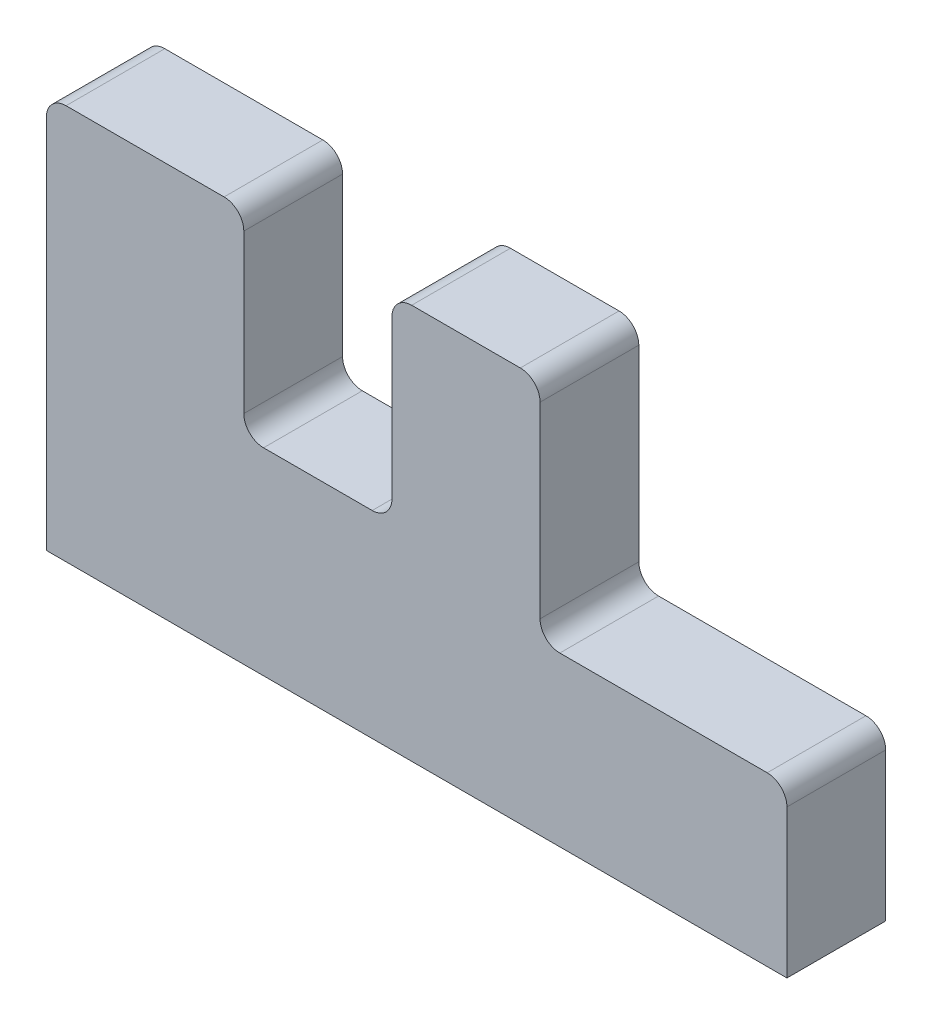
ISO-10303-21;
HEADER;
FILE_DESCRIPTION(('STEP AP214'),'2;1');
FILE_NAME('part.step','',(''),(''),'','','');
FILE_SCHEMA(('AUTOMOTIVE_DESIGN { 1 0 10303 214 1 1 1 1 }'));
ENDSEC;
DATA;
#1=APPLICATION_CONTEXT('core data for automotive mechanical design processes');
#2=APPLICATION_PROTOCOL_DEFINITION('international standard','automotive_design',2000,#1);
#3=PRODUCT_CONTEXT('',#1,'mechanical');
#4=PRODUCT('Part','Part','',(#3));
#5=PRODUCT_RELATED_PRODUCT_CATEGORY('part','',(#4));
#6=PRODUCT_DEFINITION_FORMATION('','',#4);
#7=PRODUCT_DEFINITION_CONTEXT('part definition',#1,'design');
#8=PRODUCT_DEFINITION('design','',#6,#7);
#9=PRODUCT_DEFINITION_SHAPE('','',#8);
#10=(LENGTH_UNIT() NAMED_UNIT(*) SI_UNIT(.MILLI.,.METRE.));
#11=(NAMED_UNIT(*) PLANE_ANGLE_UNIT() SI_UNIT($,.RADIAN.));
#12=(NAMED_UNIT(*) SI_UNIT($,.STERADIAN.) SOLID_ANGLE_UNIT());
#13=UNCERTAINTY_MEASURE_WITH_UNIT(LENGTH_MEASURE(1.E-05),#10,'distance_accuracy_value','');
#14=(GEOMETRIC_REPRESENTATION_CONTEXT(3) GLOBAL_UNCERTAINTY_ASSIGNED_CONTEXT((#13)) GLOBAL_UNIT_ASSIGNED_CONTEXT((#10,
#11,#12)) REPRESENTATION_CONTEXT('',''));
#15=CARTESIAN_POINT('',(0.,0.,0.));
#16=DIRECTION('',(0.,0.,1.));
#17=DIRECTION('',(1.,0.,0.));
#18=AXIS2_PLACEMENT_3D('',#15,#16,#17);
#19=CARTESIAN_POINT('',(95.25,0.,12.7));
#20=DIRECTION('',(0.,1.,0.));
#21=DIRECTION('',(0.,0.,1.));
#22=AXIS2_PLACEMENT_3D('',#19,#20,#21);
#23=PLANE('',#22);
#24=DIRECTION('',(1.,0.,0.));
#25=VECTOR('',#24,1.);
#26=CARTESIAN_POINT('',(95.25,0.,0.));
#27=LINE('',#26,#25);
#28=CARTESIAN_POINT('',(0.,0.,0.));
#29=VERTEX_POINT('',#28);
#30=CARTESIAN_POINT('',(95.25,0.,0.));
#31=VERTEX_POINT('',#30);
#32=EDGE_CURVE('E183',#29,#31,#27,.T.);
#33=ORIENTED_EDGE('',*,*,#32,.T.);
#34=DIRECTION('',(0.,0.,-1.));
#35=VECTOR('',#34,1.);
#36=CARTESIAN_POINT('',(95.25,0.,12.7));
#37=LINE('',#36,#35);
#38=CARTESIAN_POINT('',(95.25,0.,12.7));
#39=VERTEX_POINT('',#38);
#40=EDGE_CURVE('E164',#39,#31,#37,.T.);
#41=ORIENTED_EDGE('',*,*,#40,.F.);
#42=DIRECTION('',(1.,0.,0.));
#43=VECTOR('',#42,1.);
#44=CARTESIAN_POINT('',(95.25,0.,12.7));
#45=LINE('',#44,#43);
#46=CARTESIAN_POINT('',(0.,0.,12.7));
#47=VERTEX_POINT('',#46);
#48=EDGE_CURVE('E170',#47,#39,#45,.T.);
#49=ORIENTED_EDGE('',*,*,#48,.F.);
#50=DIRECTION('',(0.,0.,-1.));
#51=VECTOR('',#50,1.);
#52=CARTESIAN_POINT('',(0.,0.,12.7));
#53=LINE('',#52,#51);
#54=EDGE_CURVE('E185',#47,#29,#53,.T.);
#55=ORIENTED_EDGE('',*,*,#54,.T.);
#56=EDGE_LOOP('',(#33,#41,#49,#55));
#57=FACE_BOUND('',#56,.T.);
#58=ADVANCED_FACE('F33',(#57),#23,.F.);
#59=CARTESIAN_POINT('',(95.25,21.59,12.7));
#60=DIRECTION('',(-1.,0.,0.));
#61=DIRECTION('',(0.,0.,1.));
#62=AXIS2_PLACEMENT_3D('',#59,#60,#61);
#63=PLANE('',#62);
#64=DIRECTION('',(0.,1.,0.));
#65=VECTOR('',#64,1.);
#66=CARTESIAN_POINT('',(95.25,21.59,0.));
#67=LINE('',#66,#65);
#68=CARTESIAN_POINT('',(95.25,19.05,0.));
#69=VERTEX_POINT('',#68);
#70=EDGE_CURVE('E270',#31,#69,#67,.T.);
#71=ORIENTED_EDGE('',*,*,#70,.T.);
#72=DIRECTION('',(0.,0.,-1.));
#73=VECTOR('',#72,1.);
#74=CARTESIAN_POINT('',(95.25,19.05,12.7));
#75=LINE('',#74,#73);
#76=CARTESIAN_POINT('',(95.25,19.05,12.7));
#77=VERTEX_POINT('',#76);
#78=EDGE_CURVE('E167',#69,#77,#75,.F.);
#79=ORIENTED_EDGE('',*,*,#78,.T.);
#80=DIRECTION('',(0.,1.,0.));
#81=VECTOR('',#80,1.);
#82=CARTESIAN_POINT('',(95.25,21.59,12.7));
#83=LINE('',#82,#81);
#84=EDGE_CURVE('E159',#39,#77,#83,.T.);
#85=ORIENTED_EDGE('',*,*,#84,.F.);
#86=ORIENTED_EDGE('',*,*,#40,.T.);
#87=EDGE_LOOP('',(#71,#79,#85,#86));
#88=FACE_BOUND('',#87,.T.);
#89=ADVANCED_FACE('F162',(#88),#63,.F.);
#90=CARTESIAN_POINT('',(63.5,21.59,12.7));
#91=DIRECTION('',(0.,-1.,0.));
#92=DIRECTION('',(0.,0.,-1.));
#93=AXIS2_PLACEMENT_3D('',#90,#91,#92);
#94=PLANE('',#93);
#95=DIRECTION('',(-1.,0.,0.));
#96=VECTOR('',#95,1.);
#97=CARTESIAN_POINT('',(63.5,21.59,12.7));
#98=LINE('',#97,#96);
#99=CARTESIAN_POINT('',(92.71,21.59,12.7));
#100=VERTEX_POINT('',#99);
#101=CARTESIAN_POINT('',(66.04,21.59,12.7));
#102=VERTEX_POINT('',#101);
#103=EDGE_CURVE('E169',#100,#102,#98,.T.);
#104=ORIENTED_EDGE('',*,*,#103,.F.);
#105=DIRECTION('',(0.,0.,-1.));
#106=VECTOR('',#105,1.);
#107=CARTESIAN_POINT('',(92.71,21.59,12.7));
#108=LINE('',#107,#106);
#109=CARTESIAN_POINT('',(92.71,21.59,0.));
#110=VERTEX_POINT('',#109);
#111=EDGE_CURVE('E238',#100,#110,#108,.T.);
#112=ORIENTED_EDGE('',*,*,#111,.T.);
#113=DIRECTION('',(-1.,0.,0.));
#114=VECTOR('',#113,1.);
#115=CARTESIAN_POINT('',(63.5,21.59,0.));
#116=LINE('',#115,#114);
#117=CARTESIAN_POINT('',(66.04,21.59,0.));
#118=VERTEX_POINT('',#117);
#119=EDGE_CURVE('E259',#110,#118,#116,.T.);
#120=ORIENTED_EDGE('',*,*,#119,.T.);
#121=DIRECTION('',(0.,0.,-1.));
#122=VECTOR('',#121,1.);
#123=CARTESIAN_POINT('',(66.04,21.59,12.7));
#124=LINE('',#123,#122);
#125=EDGE_CURVE('E236',#118,#102,#124,.F.);
#126=ORIENTED_EDGE('',*,*,#125,.T.);
#127=EDGE_LOOP('',(#104,#112,#120,#126));
#128=FACE_BOUND('',#127,.T.);
#129=ADVANCED_FACE('F267',(#128),#94,.F.);
#130=CARTESIAN_POINT('',(63.5,50.8,12.7));
#131=DIRECTION('',(-1.,0.,0.));
#132=DIRECTION('',(0.,0.,1.));
#133=AXIS2_PLACEMENT_3D('',#130,#131,#132);
#134=PLANE('',#133);
#135=DIRECTION('',(0.,1.,0.));
#136=VECTOR('',#135,1.);
#137=CARTESIAN_POINT('',(63.5,50.8,12.7));
#138=LINE('',#137,#136);
#139=CARTESIAN_POINT('',(63.5,24.13,12.7));
#140=VERTEX_POINT('',#139);
#141=CARTESIAN_POINT('',(63.5,48.26,12.7));
#142=VERTEX_POINT('',#141);
#143=EDGE_CURVE('E276',#140,#142,#138,.T.);
#144=ORIENTED_EDGE('',*,*,#143,.F.);
#145=DIRECTION('',(0.,0.,-1.));
#146=VECTOR('',#145,1.);
#147=CARTESIAN_POINT('',(63.5,24.13,0.));
#148=LINE('',#147,#146);
#149=CARTESIAN_POINT('',(63.5,24.13,0.));
#150=VERTEX_POINT('',#149);
#151=EDGE_CURVE('E244',#140,#150,#148,.T.);
#152=ORIENTED_EDGE('',*,*,#151,.T.);
#153=DIRECTION('',(0.,1.,0.));
#154=VECTOR('',#153,1.);
#155=CARTESIAN_POINT('',(63.5,50.8,0.));
#156=LINE('',#155,#154);
#157=CARTESIAN_POINT('',(63.5,48.26,0.));
#158=VERTEX_POINT('',#157);
#159=EDGE_CURVE('E261',#150,#158,#156,.T.);
#160=ORIENTED_EDGE('',*,*,#159,.T.);
#161=DIRECTION('',(0.,0.,-1.));
#162=VECTOR('',#161,1.);
#163=CARTESIAN_POINT('',(63.5,48.26,12.7));
#164=LINE('',#163,#162);
#165=EDGE_CURVE('E242',#158,#142,#164,.F.);
#166=ORIENTED_EDGE('',*,*,#165,.T.);
#167=EDGE_LOOP('',(#144,#152,#160,#166));
#168=FACE_BOUND('',#167,.T.);
#169=ADVANCED_FACE('F279',(#168),#134,.F.);
#170=CARTESIAN_POINT('',(44.45,50.8,12.7));
#171=DIRECTION('',(0.,-1.,0.));
#172=DIRECTION('',(0.,0.,-1.));
#173=AXIS2_PLACEMENT_3D('',#170,#171,#172);
#174=PLANE('',#173);
#175=DIRECTION('',(-1.,0.,0.));
#176=VECTOR('',#175,1.);
#177=CARTESIAN_POINT('',(44.45,50.8,0.));
#178=LINE('',#177,#176);
#179=CARTESIAN_POINT('',(60.96,50.8,0.));
#180=VERTEX_POINT('',#179);
#181=CARTESIAN_POINT('',(46.99,50.8,0.));
#182=VERTEX_POINT('',#181);
#183=EDGE_CURVE('E300',#180,#182,#178,.T.);
#184=ORIENTED_EDGE('',*,*,#183,.T.);
#185=DIRECTION('',(0.,0.,-1.));
#186=VECTOR('',#185,1.);
#187=CARTESIAN_POINT('',(46.99,50.8,12.7));
#188=LINE('',#187,#186);
#189=CARTESIAN_POINT('',(46.99,50.8,12.7));
#190=VERTEX_POINT('',#189);
#191=EDGE_CURVE('E234',#182,#190,#188,.F.);
#192=ORIENTED_EDGE('',*,*,#191,.T.);
#193=DIRECTION('',(-1.,0.,0.));
#194=VECTOR('',#193,1.);
#195=CARTESIAN_POINT('',(44.45,50.8,12.7));
#196=LINE('',#195,#194);
#197=CARTESIAN_POINT('',(60.96,50.8,12.7));
#198=VERTEX_POINT('',#197);
#199=EDGE_CURVE('E281',#198,#190,#196,.T.);
#200=ORIENTED_EDGE('',*,*,#199,.F.);
#201=DIRECTION('',(0.,0.,-1.));
#202=VECTOR('',#201,1.);
#203=CARTESIAN_POINT('',(60.96,50.8,12.7));
#204=LINE('',#203,#202);
#205=EDGE_CURVE('E231',#198,#180,#204,.T.);
#206=ORIENTED_EDGE('',*,*,#205,.T.);
#207=EDGE_LOOP('',(#184,#192,#200,#206));
#208=FACE_BOUND('',#207,.T.);
#209=ADVANCED_FACE('F387',(#208),#174,.F.);
#210=CARTESIAN_POINT('',(44.45,25.4,12.7));
#211=DIRECTION('',(1.,0.,0.));
#212=DIRECTION('',(0.,0.,-1.));
#213=AXIS2_PLACEMENT_3D('',#210,#211,#212);
#214=PLANE('',#213);
#215=DIRECTION('',(0.,-1.,0.));
#216=VECTOR('',#215,1.);
#217=CARTESIAN_POINT('',(44.45,25.4,0.));
#218=LINE('',#217,#216);
#219=CARTESIAN_POINT('',(44.45,48.26,0.));
#220=VERTEX_POINT('',#219);
#221=CARTESIAN_POINT('',(44.45,27.94,0.));
#222=VERTEX_POINT('',#221);
#223=EDGE_CURVE('E303',#220,#222,#218,.T.);
#224=ORIENTED_EDGE('',*,*,#223,.T.);
#225=DIRECTION('',(0.,0.,-1.));
#226=VECTOR('',#225,1.);
#227=CARTESIAN_POINT('',(44.45,27.94,12.7));
#228=LINE('',#227,#226);
#229=CARTESIAN_POINT('',(44.45,27.94,12.7));
#230=VERTEX_POINT('',#229);
#231=EDGE_CURVE('E229',#222,#230,#228,.F.);
#232=ORIENTED_EDGE('',*,*,#231,.T.);
#233=DIRECTION('',(0.,-1.,0.));
#234=VECTOR('',#233,1.);
#235=CARTESIAN_POINT('',(44.45,25.4,12.7));
#236=LINE('',#235,#234);
#237=CARTESIAN_POINT('',(44.45,48.26,12.7));
#238=VERTEX_POINT('',#237);
#239=EDGE_CURVE('E284',#238,#230,#236,.T.);
#240=ORIENTED_EDGE('',*,*,#239,.F.);
#241=DIRECTION('',(0.,0.,-1.));
#242=VECTOR('',#241,1.);
#243=CARTESIAN_POINT('',(44.45,48.26,12.7));
#244=LINE('',#243,#242);
#245=EDGE_CURVE('E226',#238,#220,#244,.T.);
#246=ORIENTED_EDGE('',*,*,#245,.T.);
#247=EDGE_LOOP('',(#224,#232,#240,#246));
#248=FACE_BOUND('',#247,.T.);
#249=ADVANCED_FACE('F384',(#248),#214,.F.);
#250=CARTESIAN_POINT('',(25.4,25.4,12.7));
#251=DIRECTION('',(0.,-1.,0.));
#252=DIRECTION('',(0.,0.,-1.));
#253=AXIS2_PLACEMENT_3D('',#250,#251,#252);
#254=PLANE('',#253);
#255=DIRECTION('',(-1.,0.,0.));
#256=VECTOR('',#255,1.);
#257=CARTESIAN_POINT('',(25.4,25.4,0.));
#258=LINE('',#257,#256);
#259=CARTESIAN_POINT('',(41.91,25.4,0.));
#260=VERTEX_POINT('',#259);
#261=CARTESIAN_POINT('',(27.94,25.4,0.));
#262=VERTEX_POINT('',#261);
#263=EDGE_CURVE('E306',#260,#262,#258,.T.);
#264=ORIENTED_EDGE('',*,*,#263,.T.);
#265=DIRECTION('',(0.,0.,-1.));
#266=VECTOR('',#265,1.);
#267=CARTESIAN_POINT('',(27.94,25.4,12.7));
#268=LINE('',#267,#266);
#269=CARTESIAN_POINT('',(27.94,25.4,12.7));
#270=VERTEX_POINT('',#269);
#271=EDGE_CURVE('E224',#262,#270,#268,.F.);
#272=ORIENTED_EDGE('',*,*,#271,.T.);
#273=DIRECTION('',(-1.,0.,0.));
#274=VECTOR('',#273,1.);
#275=CARTESIAN_POINT('',(25.4,25.4,12.7));
#276=LINE('',#275,#274);
#277=CARTESIAN_POINT('',(41.91,25.4,12.7));
#278=VERTEX_POINT('',#277);
#279=EDGE_CURVE('E290',#278,#270,#276,.T.);
#280=ORIENTED_EDGE('',*,*,#279,.F.);
#281=DIRECTION('',(0.,0.,-1.));
#282=VECTOR('',#281,1.);
#283=CARTESIAN_POINT('',(41.91,25.4,0.));
#284=LINE('',#283,#282);
#285=EDGE_CURVE('E221',#278,#260,#284,.T.);
#286=ORIENTED_EDGE('',*,*,#285,.T.);
#287=EDGE_LOOP('',(#264,#272,#280,#286));
#288=FACE_BOUND('',#287,.T.);
#289=ADVANCED_FACE('F358',(#288),#254,.F.);
#290=CARTESIAN_POINT('',(25.4,50.8,12.7));
#291=DIRECTION('',(-1.,0.,0.));
#292=DIRECTION('',(0.,-1.,0.));
#293=AXIS2_PLACEMENT_3D('',#290,#291,#292);
#294=PLANE('',#293);
#295=DIRECTION('',(0.,1.,0.));
#296=VECTOR('',#295,1.);
#297=CARTESIAN_POINT('',(25.4,50.8,0.));
#298=LINE('',#297,#296);
#299=CARTESIAN_POINT('',(25.4,27.94,0.));
#300=VERTEX_POINT('',#299);
#301=CARTESIAN_POINT('',(25.4,48.26,0.));
#302=VERTEX_POINT('',#301);
#303=EDGE_CURVE('E309',#300,#302,#298,.T.);
#304=ORIENTED_EDGE('',*,*,#303,.T.);
#305=DIRECTION('',(0.,0.,-1.));
#306=VECTOR('',#305,1.);
#307=CARTESIAN_POINT('',(25.4,48.26,12.7));
#308=LINE('',#307,#306);
#309=CARTESIAN_POINT('',(25.4,48.26,12.7));
#310=VERTEX_POINT('',#309);
#311=EDGE_CURVE('E48',#302,#310,#308,.F.);
#312=ORIENTED_EDGE('',*,*,#311,.T.);
#313=DIRECTION('',(0.,1.,0.));
#314=VECTOR('',#313,1.);
#315=CARTESIAN_POINT('',(25.4,50.8,12.7));
#316=LINE('',#315,#314);
#317=CARTESIAN_POINT('',(25.4,27.94,12.7));
#318=VERTEX_POINT('',#317);
#319=EDGE_CURVE('E292',#318,#310,#316,.T.);
#320=ORIENTED_EDGE('',*,*,#319,.F.);
#321=DIRECTION('',(0.,0.,-1.));
#322=VECTOR('',#321,1.);
#323=CARTESIAN_POINT('',(25.4,27.94,0.));
#324=LINE('',#323,#322);
#325=EDGE_CURVE('E217',#318,#300,#324,.T.);
#326=ORIENTED_EDGE('',*,*,#325,.T.);
#327=EDGE_LOOP('',(#304,#312,#320,#326));
#328=FACE_BOUND('',#327,.T.);
#329=ADVANCED_FACE('F363',(#328),#294,.F.);
#330=CARTESIAN_POINT('',(0.,50.8,12.7));
#331=DIRECTION('',(0.,-1.,0.));
#332=DIRECTION('',(0.,0.,-1.));
#333=AXIS2_PLACEMENT_3D('',#330,#331,#332);
#334=PLANE('',#333);
#335=DIRECTION('',(-1.,0.,0.));
#336=VECTOR('',#335,1.);
#337=CARTESIAN_POINT('',(0.,50.8,0.));
#338=LINE('',#337,#336);
#339=CARTESIAN_POINT('',(22.86,50.8,0.));
#340=VERTEX_POINT('',#339);
#341=CARTESIAN_POINT('',(2.54,50.8,0.));
#342=VERTEX_POINT('',#341);
#343=EDGE_CURVE('E311',#340,#342,#338,.T.);
#344=ORIENTED_EDGE('',*,*,#343,.T.);
#345=DIRECTION('',(0.,0.,-1.));
#346=VECTOR('',#345,1.);
#347=CARTESIAN_POINT('',(2.54,50.8,12.7));
#348=LINE('',#347,#346);
#349=CARTESIAN_POINT('',(2.54,50.8,12.7));
#350=VERTEX_POINT('',#349);
#351=EDGE_CURVE('E205',#342,#350,#348,.F.);
#352=ORIENTED_EDGE('',*,*,#351,.T.);
#353=DIRECTION('',(-1.,0.,0.));
#354=VECTOR('',#353,1.);
#355=CARTESIAN_POINT('',(0.,50.8,12.7));
#356=LINE('',#355,#354);
#357=CARTESIAN_POINT('',(22.86,50.8,12.7));
#358=VERTEX_POINT('',#357);
#359=EDGE_CURVE('E294',#358,#350,#356,.T.);
#360=ORIENTED_EDGE('',*,*,#359,.F.);
#361=DIRECTION('',(0.,0.,-1.));
#362=VECTOR('',#361,1.);
#363=CARTESIAN_POINT('',(22.86,50.8,12.7));
#364=LINE('',#363,#362);
#365=EDGE_CURVE('E202',#358,#340,#364,.T.);
#366=ORIENTED_EDGE('',*,*,#365,.T.);
#367=EDGE_LOOP('',(#344,#352,#360,#366));
#368=FACE_BOUND('',#367,.T.);
#369=ADVANCED_FACE('F369',(#368),#334,.F.);
#370=CARTESIAN_POINT('',(0.,0.,12.7));
#371=DIRECTION('',(1.,0.,0.));
#372=DIRECTION('',(0.,0.,-1.));
#373=AXIS2_PLACEMENT_3D('',#370,#371,#372);
#374=PLANE('',#373);
#375=DIRECTION('',(0.,-1.,0.));
#376=VECTOR('',#375,1.);
#377=CARTESIAN_POINT('',(0.,0.,12.7));
#378=LINE('',#377,#376);
#379=CARTESIAN_POINT('',(0.,48.26,12.7));
#380=VERTEX_POINT('',#379);
#381=EDGE_CURVE('E176',#380,#47,#378,.T.);
#382=ORIENTED_EDGE('',*,*,#381,.F.);
#383=DIRECTION('',(0.,0.,-1.));
#384=VECTOR('',#383,1.);
#385=CARTESIAN_POINT('',(0.,48.26,12.7));
#386=LINE('',#385,#384);
#387=CARTESIAN_POINT('',(0.,48.26,0.));
#388=VERTEX_POINT('',#387);
#389=EDGE_CURVE('E184',#380,#388,#386,.T.);
#390=ORIENTED_EDGE('',*,*,#389,.T.);
#391=DIRECTION('',(0.,-1.,0.));
#392=VECTOR('',#391,1.);
#393=CARTESIAN_POINT('',(0.,0.,0.));
#394=LINE('',#393,#392);
#395=EDGE_CURVE('E180',#388,#29,#394,.T.);
#396=ORIENTED_EDGE('',*,*,#395,.T.);
#397=ORIENTED_EDGE('',*,*,#54,.F.);
#398=EDGE_LOOP('',(#382,#390,#396,#397));
#399=FACE_BOUND('',#398,.T.);
#400=ADVANCED_FACE('F314',(#399),#374,.F.);
#401=CARTESIAN_POINT('',(0.,0.,12.7));
#402=DIRECTION('',(0.,0.,-1.));
#403=DIRECTION('',(-1.,0.,0.));
#404=AXIS2_PLACEMENT_3D('',#401,#402,#403);
#405=PLANE('',#404);
#406=ORIENTED_EDGE('',*,*,#359,.T.);
#407=CARTESIAN_POINT('',(2.54,48.26,12.7));
#408=DIRECTION('',(0.,0.,-1.));
#409=DIRECTION('',(-1.,0.,0.));
#410=AXIS2_PLACEMENT_3D('',#407,#408,#409);
#411=CIRCLE('',#410,2.54);
#412=EDGE_CURVE('E215',#350,#380,#411,.F.);
#413=ORIENTED_EDGE('',*,*,#412,.T.);
#414=ORIENTED_EDGE('',*,*,#381,.T.);
#415=ORIENTED_EDGE('',*,*,#48,.T.);
#416=ORIENTED_EDGE('',*,*,#84,.T.);
#417=CARTESIAN_POINT('',(92.71,19.05,12.7));
#418=DIRECTION('',(0.,0.,-1.));
#419=DIRECTION('',(-1.,0.,0.));
#420=AXIS2_PLACEMENT_3D('',#417,#418,#419);
#421=CIRCLE('',#420,2.54);
#422=EDGE_CURVE('E209',#77,#100,#421,.F.);
#423=ORIENTED_EDGE('',*,*,#422,.T.);
#424=ORIENTED_EDGE('',*,*,#103,.T.);
#425=CARTESIAN_POINT('',(66.04,24.13,12.7));
#426=DIRECTION('',(0.,0.,-1.));
#427=DIRECTION('',(-1.,0.,0.));
#428=AXIS2_PLACEMENT_3D('',#425,#426,#427);
#429=CIRCLE('',#428,2.54);
#430=EDGE_CURVE('E11',#102,#140,#429,.T.);
#431=ORIENTED_EDGE('',*,*,#430,.T.);
#432=ORIENTED_EDGE('',*,*,#143,.T.);
#433=CARTESIAN_POINT('',(60.96,48.26,12.7));
#434=DIRECTION('',(0.,0.,-1.));
#435=DIRECTION('',(-1.,0.,0.));
#436=AXIS2_PLACEMENT_3D('',#433,#434,#435);
#437=CIRCLE('',#436,2.54);
#438=EDGE_CURVE('E207',#142,#198,#437,.F.);
#439=ORIENTED_EDGE('',*,*,#438,.T.);
#440=ORIENTED_EDGE('',*,*,#199,.T.);
#441=CARTESIAN_POINT('',(46.99,48.26,12.7));
#442=DIRECTION('',(0.,0.,-1.));
#443=DIRECTION('',(-1.,0.,0.));
#444=AXIS2_PLACEMENT_3D('',#441,#442,#443);
#445=CIRCLE('',#444,2.54);
#446=EDGE_CURVE('E211',#190,#238,#445,.F.);
#447=ORIENTED_EDGE('',*,*,#446,.T.);
#448=ORIENTED_EDGE('',*,*,#239,.T.);
#449=CARTESIAN_POINT('',(41.91,27.94,12.7));
#450=DIRECTION('',(0.,0.,-1.));
#451=DIRECTION('',(-1.,0.,0.));
#452=AXIS2_PLACEMENT_3D('',#449,#450,#451);
#453=CIRCLE('',#452,2.54);
#454=EDGE_CURVE('E252',#230,#278,#453,.T.);
#455=ORIENTED_EDGE('',*,*,#454,.T.);
#456=ORIENTED_EDGE('',*,*,#279,.T.);
#457=CARTESIAN_POINT('',(27.94,27.94,12.7));
#458=DIRECTION('',(0.,0.,-1.));
#459=DIRECTION('',(-1.,0.,0.));
#460=AXIS2_PLACEMENT_3D('',#457,#458,#459);
#461=CIRCLE('',#460,2.54);
#462=EDGE_CURVE('E55',#270,#318,#461,.T.);
#463=ORIENTED_EDGE('',*,*,#462,.T.);
#464=ORIENTED_EDGE('',*,*,#319,.T.);
#465=CARTESIAN_POINT('',(22.86,48.26,12.7));
#466=DIRECTION('',(0.,0.,-1.));
#467=DIRECTION('',(-1.,0.,0.));
#468=AXIS2_PLACEMENT_3D('',#465,#466,#467);
#469=CIRCLE('',#468,2.54);
#470=EDGE_CURVE('E213',#310,#358,#469,.F.);
#471=ORIENTED_EDGE('',*,*,#470,.T.);
#472=EDGE_LOOP('',(#406,#413,#414,#415,#416,#423,#424,#431,#432,#439,#440,#447,#448,#455,#456,
#463,#464,#471));
#473=FACE_BOUND('',#472,.T.);
#474=ADVANCED_FACE('F174',(#473),#405,.F.);
#475=CARTESIAN_POINT('',(0.,0.,0.));
#476=DIRECTION('',(0.,0.,-1.));
#477=DIRECTION('',(-1.,0.,0.));
#478=AXIS2_PLACEMENT_3D('',#475,#476,#477);
#479=PLANE('',#478);
#480=ORIENTED_EDGE('',*,*,#395,.F.);
#481=CARTESIAN_POINT('',(2.54,48.26,0.));
#482=DIRECTION('',(0.,0.,-1.));
#483=DIRECTION('',(-1.,0.,0.));
#484=AXIS2_PLACEMENT_3D('',#481,#482,#483);
#485=CIRCLE('',#484,2.54);
#486=EDGE_CURVE('E200',#388,#342,#485,.T.);
#487=ORIENTED_EDGE('',*,*,#486,.T.);
#488=ORIENTED_EDGE('',*,*,#343,.F.);
#489=CARTESIAN_POINT('',(22.86,48.26,0.));
#490=DIRECTION('',(0.,0.,-1.));
#491=DIRECTION('',(-1.,0.,0.));
#492=AXIS2_PLACEMENT_3D('',#489,#490,#491);
#493=CIRCLE('',#492,2.54);
#494=EDGE_CURVE('E198',#340,#302,#493,.T.);
#495=ORIENTED_EDGE('',*,*,#494,.T.);
#496=ORIENTED_EDGE('',*,*,#303,.F.);
#497=CARTESIAN_POINT('',(27.94,27.94,0.));
#498=DIRECTION('',(0.,0.,-1.));
#499=DIRECTION('',(-1.,0.,0.));
#500=AXIS2_PLACEMENT_3D('',#497,#498,#499);
#501=CIRCLE('',#500,2.54);
#502=EDGE_CURVE('E247',#300,#262,#501,.F.);
#503=ORIENTED_EDGE('',*,*,#502,.T.);
#504=ORIENTED_EDGE('',*,*,#263,.F.);
#505=CARTESIAN_POINT('',(41.91,27.94,0.));
#506=DIRECTION('',(0.,0.,-1.));
#507=DIRECTION('',(-1.,0.,0.));
#508=AXIS2_PLACEMENT_3D('',#505,#506,#507);
#509=CIRCLE('',#508,2.54);
#510=EDGE_CURVE('E250',#260,#222,#509,.F.);
#511=ORIENTED_EDGE('',*,*,#510,.T.);
#512=ORIENTED_EDGE('',*,*,#223,.F.);
#513=CARTESIAN_POINT('',(46.99,48.26,0.));
#514=DIRECTION('',(0.,0.,-1.));
#515=DIRECTION('',(-1.,0.,0.));
#516=AXIS2_PLACEMENT_3D('',#513,#514,#515);
#517=CIRCLE('',#516,2.54);
#518=EDGE_CURVE('E196',#220,#182,#517,.T.);
#519=ORIENTED_EDGE('',*,*,#518,.T.);
#520=ORIENTED_EDGE('',*,*,#183,.F.);
#521=CARTESIAN_POINT('',(60.96,48.26,0.));
#522=DIRECTION('',(0.,0.,-1.));
#523=DIRECTION('',(-1.,0.,0.));
#524=AXIS2_PLACEMENT_3D('',#521,#522,#523);
#525=CIRCLE('',#524,2.54);
#526=EDGE_CURVE('E188',#180,#158,#525,.T.);
#527=ORIENTED_EDGE('',*,*,#526,.T.);
#528=ORIENTED_EDGE('',*,*,#159,.F.);
#529=CARTESIAN_POINT('',(66.04,24.13,0.));
#530=DIRECTION('',(0.,0.,-1.));
#531=DIRECTION('',(-1.,0.,0.));
#532=AXIS2_PLACEMENT_3D('',#529,#530,#531);
#533=CIRCLE('',#532,2.54);
#534=EDGE_CURVE('E41',#150,#118,#533,.F.);
#535=ORIENTED_EDGE('',*,*,#534,.T.);
#536=ORIENTED_EDGE('',*,*,#119,.F.);
#537=CARTESIAN_POINT('',(92.71,19.05,0.));
#538=DIRECTION('',(0.,0.,-1.));
#539=DIRECTION('',(-1.,0.,0.));
#540=AXIS2_PLACEMENT_3D('',#537,#538,#539);
#541=CIRCLE('',#540,2.54);
#542=EDGE_CURVE('E194',#110,#69,#541,.T.);
#543=ORIENTED_EDGE('',*,*,#542,.T.);
#544=ORIENTED_EDGE('',*,*,#70,.F.);
#545=ORIENTED_EDGE('',*,*,#32,.F.);
#546=EDGE_LOOP('',(#480,#487,#488,#495,#496,#503,#504,#511,#512,#519,#520,#527,#528,#535,#536,
#543,#544,#545));
#547=FACE_BOUND('',#546,.T.);
#548=ADVANCED_FACE('F258',(#547),#479,.T.);
#549=CARTESIAN_POINT('',(2.54,48.26,12.7));
#550=DIRECTION('',(0.,0.,-1.));
#551=DIRECTION('',(-1.,0.,0.));
#552=AXIS2_PLACEMENT_3D('',#549,#550,#551);
#553=CYLINDRICAL_SURFACE('',#552,2.54);
#554=ORIENTED_EDGE('',*,*,#412,.F.);
#555=ORIENTED_EDGE('',*,*,#351,.F.);
#556=ORIENTED_EDGE('',*,*,#486,.F.);
#557=ORIENTED_EDGE('',*,*,#389,.F.);
#558=EDGE_LOOP('',(#554,#555,#556,#557));
#559=FACE_BOUND('',#558,.T.);
#560=ADVANCED_FACE('F336',(#559),#553,.T.);
#561=CARTESIAN_POINT('',(22.86,48.26,12.7));
#562=DIRECTION('',(0.,0.,-1.));
#563=DIRECTION('',(-1.,0.,0.));
#564=AXIS2_PLACEMENT_3D('',#561,#562,#563);
#565=CYLINDRICAL_SURFACE('',#564,2.54);
#566=ORIENTED_EDGE('',*,*,#470,.F.);
#567=ORIENTED_EDGE('',*,*,#311,.F.);
#568=ORIENTED_EDGE('',*,*,#494,.F.);
#569=ORIENTED_EDGE('',*,*,#365,.F.);
#570=EDGE_LOOP('',(#566,#567,#568,#569));
#571=FACE_BOUND('',#570,.T.);
#572=ADVANCED_FACE('F339',(#571),#565,.T.);
#573=CARTESIAN_POINT('',(27.94,27.94,12.7));
#574=DIRECTION('',(0.,0.,1.));
#575=DIRECTION('',(1.,0.,0.));
#576=AXIS2_PLACEMENT_3D('',#573,#574,#575);
#577=CYLINDRICAL_SURFACE('',#576,2.54);
#578=ORIENTED_EDGE('',*,*,#462,.F.);
#579=ORIENTED_EDGE('',*,*,#271,.F.);
#580=ORIENTED_EDGE('',*,*,#502,.F.);
#581=ORIENTED_EDGE('',*,*,#325,.F.);
#582=EDGE_LOOP('',(#578,#579,#580,#581));
#583=FACE_BOUND('',#582,.T.);
#584=ADVANCED_FACE('F343',(#583),#577,.F.);
#585=CARTESIAN_POINT('',(41.91,27.94,12.7));
#586=DIRECTION('',(0.,0.,1.));
#587=DIRECTION('',(1.,0.,0.));
#588=AXIS2_PLACEMENT_3D('',#585,#586,#587);
#589=CYLINDRICAL_SURFACE('',#588,2.54);
#590=ORIENTED_EDGE('',*,*,#454,.F.);
#591=ORIENTED_EDGE('',*,*,#231,.F.);
#592=ORIENTED_EDGE('',*,*,#510,.F.);
#593=ORIENTED_EDGE('',*,*,#285,.F.);
#594=EDGE_LOOP('',(#590,#591,#592,#593));
#595=FACE_BOUND('',#594,.T.);
#596=ADVANCED_FACE('F325',(#595),#589,.F.);
#597=CARTESIAN_POINT('',(46.99,48.26,12.7));
#598=DIRECTION('',(0.,0.,-1.));
#599=DIRECTION('',(-1.,0.,0.));
#600=AXIS2_PLACEMENT_3D('',#597,#598,#599);
#601=CYLINDRICAL_SURFACE('',#600,2.54);
#602=ORIENTED_EDGE('',*,*,#446,.F.);
#603=ORIENTED_EDGE('',*,*,#191,.F.);
#604=ORIENTED_EDGE('',*,*,#518,.F.);
#605=ORIENTED_EDGE('',*,*,#245,.F.);
#606=EDGE_LOOP('',(#602,#603,#604,#605));
#607=FACE_BOUND('',#606,.T.);
#608=ADVANCED_FACE('F319',(#607),#601,.T.);
#609=CARTESIAN_POINT('',(92.71,19.05,12.7));
#610=DIRECTION('',(0.,0.,-1.));
#611=DIRECTION('',(-1.,0.,0.));
#612=AXIS2_PLACEMENT_3D('',#609,#610,#611);
#613=CYLINDRICAL_SURFACE('',#612,2.54);
#614=ORIENTED_EDGE('',*,*,#422,.F.);
#615=ORIENTED_EDGE('',*,*,#78,.F.);
#616=ORIENTED_EDGE('',*,*,#542,.F.);
#617=ORIENTED_EDGE('',*,*,#111,.F.);
#618=EDGE_LOOP('',(#614,#615,#616,#617));
#619=FACE_BOUND('',#618,.T.);
#620=ADVANCED_FACE('F317',(#619),#613,.T.);
#621=CARTESIAN_POINT('',(66.04,24.13,12.7));
#622=DIRECTION('',(0.,0.,1.));
#623=DIRECTION('',(1.,0.,0.));
#624=AXIS2_PLACEMENT_3D('',#621,#622,#623);
#625=CYLINDRICAL_SURFACE('',#624,2.54);
#626=ORIENTED_EDGE('',*,*,#430,.F.);
#627=ORIENTED_EDGE('',*,*,#125,.F.);
#628=ORIENTED_EDGE('',*,*,#534,.F.);
#629=ORIENTED_EDGE('',*,*,#151,.F.);
#630=EDGE_LOOP('',(#626,#627,#628,#629));
#631=FACE_BOUND('',#630,.T.);
#632=ADVANCED_FACE('F273',(#631),#625,.F.);
#633=CARTESIAN_POINT('',(60.96,48.26,12.7));
#634=DIRECTION('',(0.,0.,-1.));
#635=DIRECTION('',(-1.,0.,0.));
#636=AXIS2_PLACEMENT_3D('',#633,#634,#635);
#637=CYLINDRICAL_SURFACE('',#636,2.54);
#638=ORIENTED_EDGE('',*,*,#438,.F.);
#639=ORIENTED_EDGE('',*,*,#165,.F.);
#640=ORIENTED_EDGE('',*,*,#526,.F.);
#641=ORIENTED_EDGE('',*,*,#205,.F.);
#642=EDGE_LOOP('',(#638,#639,#640,#641));
#643=FACE_BOUND('',#642,.T.);
#644=ADVANCED_FACE('F35',(#643),#637,.T.);
#645=CLOSED_SHELL('',(#58,#89,#129,#169,#209,#249,#289,#329,#369,#400,#474,#548,#560,#572,#584,
#596,#608,#620,#632,#644));
#646=MANIFOLD_SOLID_BREP('B2',#645);
#647=ADVANCED_BREP_SHAPE_REPRESENTATION('',(#18,#646),#14);
#648=SHAPE_DEFINITION_REPRESENTATION(#9,#647);
ENDSEC;
END-ISO-10303-21;
